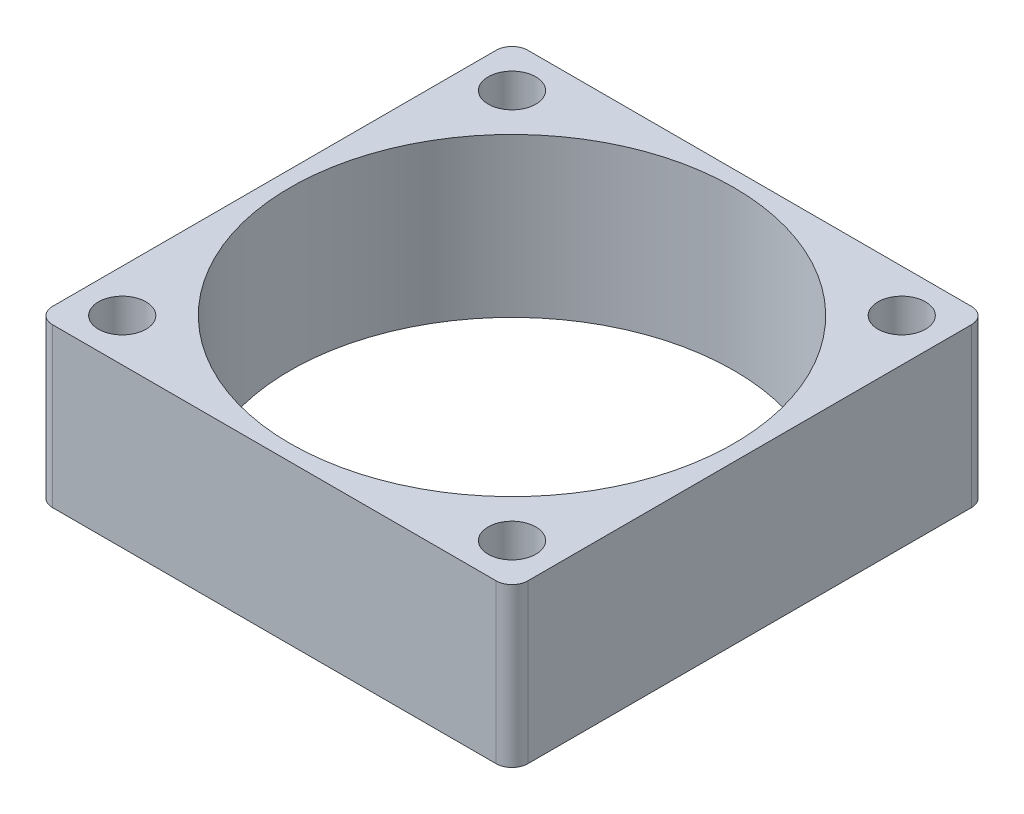
ISO-10303-21;
HEADER;
FILE_DESCRIPTION(('STEP AP214'),'2;1');
FILE_NAME('part.step','',(''),(''),'','','');
FILE_SCHEMA(('AUTOMOTIVE_DESIGN { 1 0 10303 214 1 1 1 1 }'));
ENDSEC;
DATA;
#1=APPLICATION_CONTEXT('core data for automotive mechanical design processes');
#2=APPLICATION_PROTOCOL_DEFINITION('international standard','automotive_design',2000,#1);
#3=PRODUCT_CONTEXT('',#1,'mechanical');
#4=PRODUCT('Part','Part','',(#3));
#5=PRODUCT_RELATED_PRODUCT_CATEGORY('part','',(#4));
#6=PRODUCT_DEFINITION_FORMATION('','',#4);
#7=PRODUCT_DEFINITION_CONTEXT('part definition',#1,'design');
#8=PRODUCT_DEFINITION('design','',#6,#7);
#9=PRODUCT_DEFINITION_SHAPE('','',#8);
#10=(LENGTH_UNIT() NAMED_UNIT(*) SI_UNIT(.MILLI.,.METRE.));
#11=(NAMED_UNIT(*) PLANE_ANGLE_UNIT() SI_UNIT($,.RADIAN.));
#12=(NAMED_UNIT(*) SI_UNIT($,.STERADIAN.) SOLID_ANGLE_UNIT());
#13=UNCERTAINTY_MEASURE_WITH_UNIT(LENGTH_MEASURE(1.E-05),#10,'distance_accuracy_value','');
#14=(GEOMETRIC_REPRESENTATION_CONTEXT(3) GLOBAL_UNCERTAINTY_ASSIGNED_CONTEXT((#13)) GLOBAL_UNIT_ASSIGNED_CONTEXT((#10,
#11,#12)) REPRESENTATION_CONTEXT('',''));
#15=CARTESIAN_POINT('',(0.,0.,0.));
#16=DIRECTION('',(0.,0.,1.));
#17=DIRECTION('',(1.,0.,0.));
#18=AXIS2_PLACEMENT_3D('',#15,#16,#17);
#19=CARTESIAN_POINT('',(15.,10.,-15.));
#20=DIRECTION('',(-1.,0.,0.));
#21=DIRECTION('',(0.,0.,1.));
#22=AXIS2_PLACEMENT_3D('',#19,#20,#21);
#23=PLANE('',#22);
#24=DIRECTION('',(0.,0.,-1.));
#25=VECTOR('',#24,1.);
#26=CARTESIAN_POINT('',(15.,10.,-15.));
#27=LINE('',#26,#25);
#28=CARTESIAN_POINT('',(15.,10.,14.));
#29=VERTEX_POINT('',#28);
#30=CARTESIAN_POINT('',(15.,10.,-14.));
#31=VERTEX_POINT('',#30);
#32=EDGE_CURVE('E132',#29,#31,#27,.T.);
#33=ORIENTED_EDGE('',*,*,#32,.F.);
#34=DIRECTION('',(0.,-1.,0.));
#35=VECTOR('',#34,1.);
#36=CARTESIAN_POINT('',(15.,10.,14.));
#37=LINE('',#36,#35);
#38=CARTESIAN_POINT('',(15.,0.,14.));
#39=VERTEX_POINT('',#38);
#40=EDGE_CURVE('E11',#29,#39,#37,.T.);
#41=ORIENTED_EDGE('',*,*,#40,.T.);
#42=DIRECTION('',(0.,0.,-1.));
#43=VECTOR('',#42,1.);
#44=CARTESIAN_POINT('',(15.,0.,-15.));
#45=LINE('',#44,#43);
#46=CARTESIAN_POINT('',(15.,0.,-14.));
#47=VERTEX_POINT('',#46);
#48=EDGE_CURVE('E134',#39,#47,#45,.T.);
#49=ORIENTED_EDGE('',*,*,#48,.T.);
#50=DIRECTION('',(0.,-1.,0.));
#51=VECTOR('',#50,1.);
#52=CARTESIAN_POINT('',(15.,10.,-14.));
#53=LINE('',#52,#51);
#54=EDGE_CURVE('E45',#47,#31,#53,.F.);
#55=ORIENTED_EDGE('',*,*,#54,.T.);
#56=EDGE_LOOP('',(#33,#41,#49,#55));
#57=FACE_BOUND('',#56,.T.);
#58=ADVANCED_FACE('F37',(#57),#23,.F.);
#59=CARTESIAN_POINT('',(-15.,10.,-15.));
#60=DIRECTION('',(0.,0.,1.));
#61=DIRECTION('',(1.,0.,0.));
#62=AXIS2_PLACEMENT_3D('',#59,#60,#61);
#63=PLANE('',#62);
#64=DIRECTION('',(-1.,0.,0.));
#65=VECTOR('',#64,1.);
#66=CARTESIAN_POINT('',(-15.,0.,-15.));
#67=LINE('',#66,#65);
#68=CARTESIAN_POINT('',(14.,0.,-15.));
#69=VERTEX_POINT('',#68);
#70=CARTESIAN_POINT('',(-14.,0.,-15.));
#71=VERTEX_POINT('',#70);
#72=EDGE_CURVE('E130',#69,#71,#67,.T.);
#73=ORIENTED_EDGE('',*,*,#72,.T.);
#74=DIRECTION('',(0.,-1.,0.));
#75=VECTOR('',#74,1.);
#76=CARTESIAN_POINT('',(-14.,10.,-15.));
#77=LINE('',#76,#75);
#78=CARTESIAN_POINT('',(-14.,10.,-15.));
#79=VERTEX_POINT('',#78);
#80=EDGE_CURVE('E109',#71,#79,#77,.F.);
#81=ORIENTED_EDGE('',*,*,#80,.T.);
#82=DIRECTION('',(-1.,0.,0.));
#83=VECTOR('',#82,1.);
#84=CARTESIAN_POINT('',(-15.,10.,-15.));
#85=LINE('',#84,#83);
#86=CARTESIAN_POINT('',(14.,10.,-15.));
#87=VERTEX_POINT('',#86);
#88=EDGE_CURVE('E170',#87,#79,#85,.T.);
#89=ORIENTED_EDGE('',*,*,#88,.F.);
#90=DIRECTION('',(0.,-1.,0.));
#91=VECTOR('',#90,1.);
#92=CARTESIAN_POINT('',(14.,10.,-15.));
#93=LINE('',#92,#91);
#94=EDGE_CURVE('E114',#87,#69,#93,.T.);
#95=ORIENTED_EDGE('',*,*,#94,.T.);
#96=EDGE_LOOP('',(#73,#81,#89,#95));
#97=FACE_BOUND('',#96,.T.);
#98=ADVANCED_FACE('F174',(#97),#63,.F.);
#99=CARTESIAN_POINT('',(-15.,10.,-15.));
#100=DIRECTION('',(1.,0.,0.));
#101=DIRECTION('',(0.,0.,-1.));
#102=AXIS2_PLACEMENT_3D('',#99,#100,#101);
#103=PLANE('',#102);
#104=DIRECTION('',(0.,0.,1.));
#105=VECTOR('',#104,1.);
#106=CARTESIAN_POINT('',(-15.,10.,-15.));
#107=LINE('',#106,#105);
#108=CARTESIAN_POINT('',(-15.,10.,-14.));
#109=VERTEX_POINT('',#108);
#110=CARTESIAN_POINT('',(-15.,10.,14.));
#111=VERTEX_POINT('',#110);
#112=EDGE_CURVE('E123',#109,#111,#107,.T.);
#113=ORIENTED_EDGE('',*,*,#112,.F.);
#114=DIRECTION('',(0.,-1.,0.));
#115=VECTOR('',#114,1.);
#116=CARTESIAN_POINT('',(-15.,10.,-14.));
#117=LINE('',#116,#115);
#118=CARTESIAN_POINT('',(-15.,0.,-14.));
#119=VERTEX_POINT('',#118);
#120=EDGE_CURVE('E108',#109,#119,#117,.T.);
#121=ORIENTED_EDGE('',*,*,#120,.T.);
#122=DIRECTION('',(0.,0.,1.));
#123=VECTOR('',#122,1.);
#124=CARTESIAN_POINT('',(-15.,0.,-15.));
#125=LINE('',#124,#123);
#126=CARTESIAN_POINT('',(-15.,0.,14.));
#127=VERTEX_POINT('',#126);
#128=EDGE_CURVE('E121',#119,#127,#125,.T.);
#129=ORIENTED_EDGE('',*,*,#128,.T.);
#130=DIRECTION('',(0.,-1.,0.));
#131=VECTOR('',#130,1.);
#132=CARTESIAN_POINT('',(-15.,10.,14.));
#133=LINE('',#132,#131);
#134=EDGE_CURVE('E125',#127,#111,#133,.F.);
#135=ORIENTED_EDGE('',*,*,#134,.T.);
#136=EDGE_LOOP('',(#113,#121,#129,#135));
#137=FACE_BOUND('',#136,.T.);
#138=ADVANCED_FACE('F120',(#137),#103,.F.);
#139=CARTESIAN_POINT('',(-15.,10.,15.));
#140=DIRECTION('',(0.,0.,-1.));
#141=DIRECTION('',(-1.,0.,0.));
#142=AXIS2_PLACEMENT_3D('',#139,#140,#141);
#143=PLANE('',#142);
#144=DIRECTION('',(1.,0.,0.));
#145=VECTOR('',#144,1.);
#146=CARTESIAN_POINT('',(-15.,10.,15.));
#147=LINE('',#146,#145);
#148=CARTESIAN_POINT('',(-14.,10.,15.));
#149=VERTEX_POINT('',#148);
#150=CARTESIAN_POINT('',(14.,10.,15.));
#151=VERTEX_POINT('',#150);
#152=EDGE_CURVE('E138',#149,#151,#147,.T.);
#153=ORIENTED_EDGE('',*,*,#152,.F.);
#154=DIRECTION('',(0.,-1.,0.));
#155=VECTOR('',#154,1.);
#156=CARTESIAN_POINT('',(-14.,10.,15.));
#157=LINE('',#156,#155);
#158=CARTESIAN_POINT('',(-14.,0.,15.));
#159=VERTEX_POINT('',#158);
#160=EDGE_CURVE('E155',#149,#159,#157,.T.);
#161=ORIENTED_EDGE('',*,*,#160,.T.);
#162=DIRECTION('',(1.,0.,0.));
#163=VECTOR('',#162,1.);
#164=CARTESIAN_POINT('',(-15.,0.,15.));
#165=LINE('',#164,#163);
#166=CARTESIAN_POINT('',(14.,0.,15.));
#167=VERTEX_POINT('',#166);
#168=EDGE_CURVE('E129',#159,#167,#165,.T.);
#169=ORIENTED_EDGE('',*,*,#168,.T.);
#170=DIRECTION('',(0.,-1.,0.));
#171=VECTOR('',#170,1.);
#172=CARTESIAN_POINT('',(14.,10.,15.));
#173=LINE('',#172,#171);
#174=EDGE_CURVE('E52',#167,#151,#173,.F.);
#175=ORIENTED_EDGE('',*,*,#174,.T.);
#176=EDGE_LOOP('',(#153,#161,#169,#175));
#177=FACE_BOUND('',#176,.T.);
#178=ADVANCED_FACE('F220',(#177),#143,.F.);
#179=CARTESIAN_POINT('',(0.,10.,0.));
#180=DIRECTION('',(0.,1.,0.));
#181=DIRECTION('',(0.,0.,1.));
#182=AXIS2_PLACEMENT_3D('',#179,#180,#181);
#183=PLANE('',#182);
#184=CARTESIAN_POINT('',(0.,10.,0.));
#185=DIRECTION('',(0.,1.,0.));
#186=DIRECTION('',(0.,0.,1.));
#187=AXIS2_PLACEMENT_3D('',#184,#185,#186);
#188=CIRCLE('',#187,14.);
#189=CARTESIAN_POINT('',(0.,10.,14.));
#190=VERTEX_POINT('',#189);
#191=EDGE_CURVE('E204',#190,#190,#188,.T.);
#192=ORIENTED_EDGE('',*,*,#191,.F.);
#193=EDGE_LOOP('',(#192));
#194=FACE_BOUND('',#193,.T.);
#195=CARTESIAN_POINT('',(12.3,10.,-12.3));
#196=DIRECTION('',(0.,1.,0.));
#197=DIRECTION('',(0.,0.,1.));
#198=AXIS2_PLACEMENT_3D('',#195,#196,#197);
#199=CIRCLE('',#198,1.5);
#200=CARTESIAN_POINT('',(12.3,10.,-10.8));
#201=VERTEX_POINT('',#200);
#202=EDGE_CURVE('E184',#201,#201,#199,.T.);
#203=ORIENTED_EDGE('',*,*,#202,.F.);
#204=EDGE_LOOP('',(#203));
#205=FACE_BOUND('',#204,.T.);
#206=CARTESIAN_POINT('',(-12.3,10.,12.3));
#207=DIRECTION('',(0.,1.,0.));
#208=DIRECTION('',(0.,0.,1.));
#209=AXIS2_PLACEMENT_3D('',#206,#207,#208);
#210=CIRCLE('',#209,1.5);
#211=CARTESIAN_POINT('',(-12.3,10.,13.8));
#212=VERTEX_POINT('',#211);
#213=EDGE_CURVE('E189',#212,#212,#210,.T.);
#214=ORIENTED_EDGE('',*,*,#213,.F.);
#215=EDGE_LOOP('',(#214));
#216=FACE_BOUND('',#215,.T.);
#217=CARTESIAN_POINT('',(12.3,10.,12.3));
#218=DIRECTION('',(0.,1.,0.));
#219=DIRECTION('',(0.,0.,1.));
#220=AXIS2_PLACEMENT_3D('',#217,#218,#219);
#221=CIRCLE('',#220,1.5);
#222=CARTESIAN_POINT('',(12.3,10.,13.8));
#223=VERTEX_POINT('',#222);
#224=EDGE_CURVE('E190',#223,#223,#221,.T.);
#225=ORIENTED_EDGE('',*,*,#224,.F.);
#226=EDGE_LOOP('',(#225));
#227=FACE_BOUND('',#226,.T.);
#228=CARTESIAN_POINT('',(-12.3,10.,-12.3));
#229=DIRECTION('',(0.,1.,0.));
#230=DIRECTION('',(0.,0.,1.));
#231=AXIS2_PLACEMENT_3D('',#228,#229,#230);
#232=CIRCLE('',#231,1.5);
#233=CARTESIAN_POINT('',(-12.3,10.,-10.8));
#234=VERTEX_POINT('',#233);
#235=EDGE_CURVE('E177',#234,#234,#232,.T.);
#236=ORIENTED_EDGE('',*,*,#235,.F.);
#237=EDGE_LOOP('',(#236));
#238=FACE_BOUND('',#237,.T.);
#239=ORIENTED_EDGE('',*,*,#88,.T.);
#240=CARTESIAN_POINT('',(-14.,10.,-14.));
#241=DIRECTION('',(0.,1.,0.));
#242=DIRECTION('',(0.,0.,1.));
#243=AXIS2_PLACEMENT_3D('',#240,#241,#242);
#244=CIRCLE('',#243,1.);
#245=EDGE_CURVE('E152',#79,#109,#244,.T.);
#246=ORIENTED_EDGE('',*,*,#245,.T.);
#247=ORIENTED_EDGE('',*,*,#112,.T.);
#248=CARTESIAN_POINT('',(-14.,10.,14.));
#249=DIRECTION('',(0.,1.,0.));
#250=DIRECTION('',(0.,0.,1.));
#251=AXIS2_PLACEMENT_3D('',#248,#249,#250);
#252=CIRCLE('',#251,1.);
#253=EDGE_CURVE('E59',#111,#149,#252,.T.);
#254=ORIENTED_EDGE('',*,*,#253,.T.);
#255=ORIENTED_EDGE('',*,*,#152,.T.);
#256=CARTESIAN_POINT('',(14.,10.,14.));
#257=DIRECTION('',(0.,1.,0.));
#258=DIRECTION('',(0.,0.,1.));
#259=AXIS2_PLACEMENT_3D('',#256,#257,#258);
#260=CIRCLE('',#259,1.);
#261=EDGE_CURVE('E149',#151,#29,#260,.T.);
#262=ORIENTED_EDGE('',*,*,#261,.T.);
#263=ORIENTED_EDGE('',*,*,#32,.T.);
#264=CARTESIAN_POINT('',(14.,10.,-14.));
#265=DIRECTION('',(0.,1.,0.));
#266=DIRECTION('',(0.,0.,1.));
#267=AXIS2_PLACEMENT_3D('',#264,#265,#266);
#268=CIRCLE('',#267,1.);
#269=EDGE_CURVE('E147',#31,#87,#268,.T.);
#270=ORIENTED_EDGE('',*,*,#269,.T.);
#271=EDGE_LOOP('',(#239,#246,#247,#254,#255,#262,#263,#270));
#272=FACE_BOUND('',#271,.T.);
#273=ADVANCED_FACE('F167',(#194,#205,#216,#227,#238,#272),#183,.T.);
#274=CARTESIAN_POINT('',(0.,0.,0.));
#275=DIRECTION('',(0.,1.,0.));
#276=DIRECTION('',(0.,0.,1.));
#277=AXIS2_PLACEMENT_3D('',#274,#275,#276);
#278=PLANE('',#277);
#279=CARTESIAN_POINT('',(0.,0.,0.));
#280=DIRECTION('',(0.,1.,0.));
#281=DIRECTION('',(0.,0.,1.));
#282=AXIS2_PLACEMENT_3D('',#279,#280,#281);
#283=CIRCLE('',#282,14.);
#284=CARTESIAN_POINT('',(0.,0.,14.));
#285=VERTEX_POINT('',#284);
#286=EDGE_CURVE('E201',#285,#285,#283,.T.);
#287=ORIENTED_EDGE('',*,*,#286,.T.);
#288=EDGE_LOOP('',(#287));
#289=FACE_BOUND('',#288,.T.);
#290=CARTESIAN_POINT('',(12.3,0.,-12.3));
#291=DIRECTION('',(0.,1.,0.));
#292=DIRECTION('',(0.,0.,1.));
#293=AXIS2_PLACEMENT_3D('',#290,#291,#292);
#294=CIRCLE('',#293,1.5);
#295=CARTESIAN_POINT('',(12.3,0.,-10.8));
#296=VERTEX_POINT('',#295);
#297=EDGE_CURVE('E193',#296,#296,#294,.T.);
#298=ORIENTED_EDGE('',*,*,#297,.T.);
#299=EDGE_LOOP('',(#298));
#300=FACE_BOUND('',#299,.T.);
#301=CARTESIAN_POINT('',(-12.3,0.,12.3));
#302=DIRECTION('',(0.,1.,0.));
#303=DIRECTION('',(0.,0.,1.));
#304=AXIS2_PLACEMENT_3D('',#301,#302,#303);
#305=CIRCLE('',#304,1.5);
#306=CARTESIAN_POINT('',(-12.3,0.,13.8));
#307=VERTEX_POINT('',#306);
#308=EDGE_CURVE('E186',#307,#307,#305,.T.);
#309=ORIENTED_EDGE('',*,*,#308,.T.);
#310=EDGE_LOOP('',(#309));
#311=FACE_BOUND('',#310,.T.);
#312=CARTESIAN_POINT('',(12.3,0.,12.3));
#313=DIRECTION('',(0.,1.,0.));
#314=DIRECTION('',(0.,0.,1.));
#315=AXIS2_PLACEMENT_3D('',#312,#313,#314);
#316=CIRCLE('',#315,1.5);
#317=CARTESIAN_POINT('',(12.3,0.,13.8));
#318=VERTEX_POINT('',#317);
#319=EDGE_CURVE('E198',#318,#318,#316,.T.);
#320=ORIENTED_EDGE('',*,*,#319,.T.);
#321=EDGE_LOOP('',(#320));
#322=FACE_BOUND('',#321,.T.);
#323=CARTESIAN_POINT('',(-12.3,0.,-12.3));
#324=DIRECTION('',(0.,1.,0.));
#325=DIRECTION('',(0.,0.,1.));
#326=AXIS2_PLACEMENT_3D('',#323,#324,#325);
#327=CIRCLE('',#326,1.5);
#328=CARTESIAN_POINT('',(-12.3,0.,-10.8));
#329=VERTEX_POINT('',#328);
#330=EDGE_CURVE('E175',#329,#329,#327,.T.);
#331=ORIENTED_EDGE('',*,*,#330,.T.);
#332=EDGE_LOOP('',(#331));
#333=FACE_BOUND('',#332,.T.);
#334=ORIENTED_EDGE('',*,*,#128,.F.);
#335=CARTESIAN_POINT('',(-14.,0.,-14.));
#336=DIRECTION('',(0.,1.,0.));
#337=DIRECTION('',(0.,0.,1.));
#338=AXIS2_PLACEMENT_3D('',#335,#336,#337);
#339=CIRCLE('',#338,1.);
#340=EDGE_CURVE('E104',#119,#71,#339,.F.);
#341=ORIENTED_EDGE('',*,*,#340,.T.);
#342=ORIENTED_EDGE('',*,*,#72,.F.);
#343=CARTESIAN_POINT('',(14.,0.,-14.));
#344=DIRECTION('',(0.,1.,0.));
#345=DIRECTION('',(0.,0.,1.));
#346=AXIS2_PLACEMENT_3D('',#343,#344,#345);
#347=CIRCLE('',#346,1.);
#348=EDGE_CURVE('E124',#69,#47,#347,.F.);
#349=ORIENTED_EDGE('',*,*,#348,.T.);
#350=ORIENTED_EDGE('',*,*,#48,.F.);
#351=CARTESIAN_POINT('',(14.,0.,14.));
#352=DIRECTION('',(0.,1.,0.));
#353=DIRECTION('',(0.,0.,1.));
#354=AXIS2_PLACEMENT_3D('',#351,#352,#353);
#355=CIRCLE('',#354,1.);
#356=EDGE_CURVE('E141',#39,#167,#355,.F.);
#357=ORIENTED_EDGE('',*,*,#356,.T.);
#358=ORIENTED_EDGE('',*,*,#168,.F.);
#359=CARTESIAN_POINT('',(-14.,0.,14.));
#360=DIRECTION('',(0.,1.,0.));
#361=DIRECTION('',(0.,0.,1.));
#362=AXIS2_PLACEMENT_3D('',#359,#360,#361);
#363=CIRCLE('',#362,1.);
#364=EDGE_CURVE('E115',#159,#127,#363,.F.);
#365=ORIENTED_EDGE('',*,*,#364,.T.);
#366=EDGE_LOOP('',(#334,#341,#342,#349,#350,#357,#358,#365));
#367=FACE_BOUND('',#366,.T.);
#368=ADVANCED_FACE('F127',(#289,#300,#311,#322,#333,#367),#278,.F.);
#369=CARTESIAN_POINT('',(-12.3,0.,-12.3));
#370=DIRECTION('',(0.,1.,0.));
#371=DIRECTION('',(0.,0.,1.));
#372=AXIS2_PLACEMENT_3D('',#369,#370,#371);
#373=CYLINDRICAL_SURFACE('',#372,1.5);
#374=ORIENTED_EDGE('',*,*,#330,.F.);
#375=EDGE_LOOP('',(#374));
#376=FACE_BOUND('',#375,.T.);
#377=ORIENTED_EDGE('',*,*,#235,.T.);
#378=EDGE_LOOP('',(#377));
#379=FACE_BOUND('',#378,.T.);
#380=ADVANCED_FACE('F230',(#376,#379),#373,.F.);
#381=CARTESIAN_POINT('',(12.3,0.,12.3));
#382=DIRECTION('',(0.,1.,0.));
#383=DIRECTION('',(0.,0.,1.));
#384=AXIS2_PLACEMENT_3D('',#381,#382,#383);
#385=CYLINDRICAL_SURFACE('',#384,1.5);
#386=ORIENTED_EDGE('',*,*,#319,.F.);
#387=EDGE_LOOP('',(#386));
#388=FACE_BOUND('',#387,.T.);
#389=ORIENTED_EDGE('',*,*,#224,.T.);
#390=EDGE_LOOP('',(#389));
#391=FACE_BOUND('',#390,.T.);
#392=ADVANCED_FACE('F232',(#388,#391),#385,.F.);
#393=CARTESIAN_POINT('',(-12.3,0.,12.3));
#394=DIRECTION('',(0.,1.,0.));
#395=DIRECTION('',(0.,0.,1.));
#396=AXIS2_PLACEMENT_3D('',#393,#394,#395);
#397=CYLINDRICAL_SURFACE('',#396,1.5);
#398=ORIENTED_EDGE('',*,*,#308,.F.);
#399=EDGE_LOOP('',(#398));
#400=FACE_BOUND('',#399,.T.);
#401=ORIENTED_EDGE('',*,*,#213,.T.);
#402=EDGE_LOOP('',(#401));
#403=FACE_BOUND('',#402,.T.);
#404=ADVANCED_FACE('F239',(#400,#403),#397,.F.);
#405=CARTESIAN_POINT('',(12.3,0.,-12.3));
#406=DIRECTION('',(0.,1.,0.));
#407=DIRECTION('',(0.,0.,1.));
#408=AXIS2_PLACEMENT_3D('',#405,#406,#407);
#409=CYLINDRICAL_SURFACE('',#408,1.5);
#410=ORIENTED_EDGE('',*,*,#297,.F.);
#411=EDGE_LOOP('',(#410));
#412=FACE_BOUND('',#411,.T.);
#413=ORIENTED_EDGE('',*,*,#202,.T.);
#414=EDGE_LOOP('',(#413));
#415=FACE_BOUND('',#414,.T.);
#416=ADVANCED_FACE('F256',(#412,#415),#409,.F.);
#417=CARTESIAN_POINT('',(-14.,10.,-14.));
#418=DIRECTION('',(0.,-1.,0.));
#419=DIRECTION('',(0.,0.,-1.));
#420=AXIS2_PLACEMENT_3D('',#417,#418,#419);
#421=CYLINDRICAL_SURFACE('',#420,1.);
#422=ORIENTED_EDGE('',*,*,#245,.F.);
#423=ORIENTED_EDGE('',*,*,#80,.F.);
#424=ORIENTED_EDGE('',*,*,#340,.F.);
#425=ORIENTED_EDGE('',*,*,#120,.F.);
#426=EDGE_LOOP('',(#422,#423,#424,#425));
#427=FACE_BOUND('',#426,.T.);
#428=ADVANCED_FACE('F107',(#427),#421,.T.);
#429=CARTESIAN_POINT('',(-14.,10.,14.));
#430=DIRECTION('',(0.,-1.,0.));
#431=DIRECTION('',(0.,0.,-1.));
#432=AXIS2_PLACEMENT_3D('',#429,#430,#431);
#433=CYLINDRICAL_SURFACE('',#432,1.);
#434=ORIENTED_EDGE('',*,*,#253,.F.);
#435=ORIENTED_EDGE('',*,*,#134,.F.);
#436=ORIENTED_EDGE('',*,*,#364,.F.);
#437=ORIENTED_EDGE('',*,*,#160,.F.);
#438=EDGE_LOOP('',(#434,#435,#436,#437));
#439=FACE_BOUND('',#438,.T.);
#440=ADVANCED_FACE('F255',(#439),#433,.T.);
#441=CARTESIAN_POINT('',(14.,10.,14.));
#442=DIRECTION('',(0.,-1.,0.));
#443=DIRECTION('',(0.,0.,-1.));
#444=AXIS2_PLACEMENT_3D('',#441,#442,#443);
#445=CYLINDRICAL_SURFACE('',#444,1.);
#446=ORIENTED_EDGE('',*,*,#261,.F.);
#447=ORIENTED_EDGE('',*,*,#174,.F.);
#448=ORIENTED_EDGE('',*,*,#356,.F.);
#449=ORIENTED_EDGE('',*,*,#40,.F.);
#450=EDGE_LOOP('',(#446,#447,#448,#449));
#451=FACE_BOUND('',#450,.T.);
#452=ADVANCED_FACE('F258',(#451),#445,.T.);
#453=CARTESIAN_POINT('',(14.,10.,-14.));
#454=DIRECTION('',(0.,-1.,0.));
#455=DIRECTION('',(0.,0.,-1.));
#456=AXIS2_PLACEMENT_3D('',#453,#454,#455);
#457=CYLINDRICAL_SURFACE('',#456,1.);
#458=ORIENTED_EDGE('',*,*,#269,.F.);
#459=ORIENTED_EDGE('',*,*,#54,.F.);
#460=ORIENTED_EDGE('',*,*,#348,.F.);
#461=ORIENTED_EDGE('',*,*,#94,.F.);
#462=EDGE_LOOP('',(#458,#459,#460,#461));
#463=FACE_BOUND('',#462,.T.);
#464=ADVANCED_FACE('F39',(#463),#457,.T.);
#465=CARTESIAN_POINT('',(0.,0.,0.));
#466=DIRECTION('',(0.,1.,0.));
#467=DIRECTION('',(0.,0.,1.));
#468=AXIS2_PLACEMENT_3D('',#465,#466,#467);
#469=CYLINDRICAL_SURFACE('',#468,14.);
#470=ORIENTED_EDGE('',*,*,#286,.F.);
#471=EDGE_LOOP('',(#470));
#472=FACE_BOUND('',#471,.T.);
#473=ORIENTED_EDGE('',*,*,#191,.T.);
#474=EDGE_LOOP('',(#473));
#475=FACE_BOUND('',#474,.T.);
#476=ADVANCED_FACE('F212',(#472,#475),#469,.F.);
#477=CLOSED_SHELL('',(#58,#98,#138,#178,#273,#368,#380,#392,#404,#416,#428,#440,#452,#464,#476));
#478=MANIFOLD_SOLID_BREP('B2',#477);
#479=ADVANCED_BREP_SHAPE_REPRESENTATION('',(#18,#478),#14);
#480=SHAPE_DEFINITION_REPRESENTATION(#9,#479);
ENDSEC;
END-ISO-10303-21;
